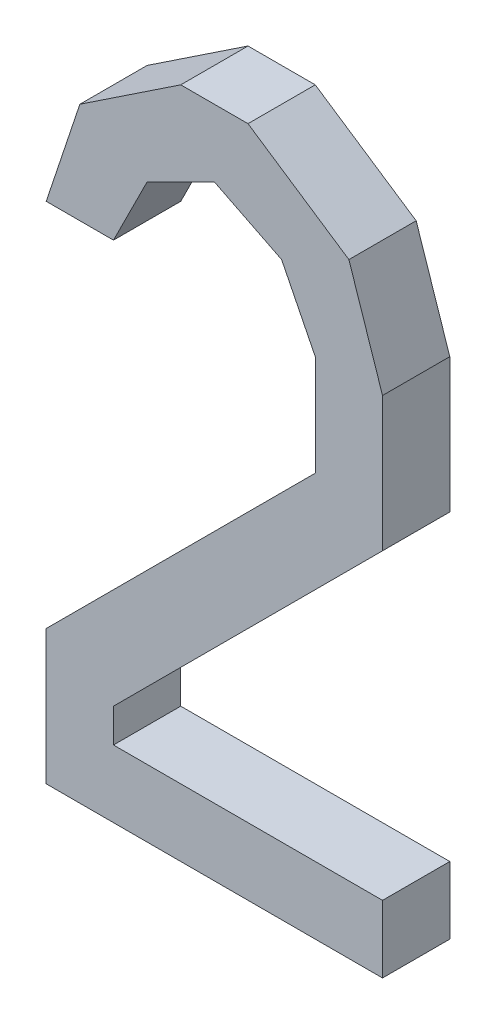
ISO-10303-21;
HEADER;
FILE_DESCRIPTION(('STEP AP214'),'2;1');
FILE_NAME('part.step','',(''),(''),'','','');
FILE_SCHEMA(('AUTOMOTIVE_DESIGN { 1 0 10303 214 1 1 1 1 }'));
ENDSEC;
DATA;
#1=APPLICATION_CONTEXT('core data for automotive mechanical design processes');
#2=APPLICATION_PROTOCOL_DEFINITION('international standard','automotive_design',2000,#1);
#3=PRODUCT_CONTEXT('',#1,'mechanical');
#4=PRODUCT('Part','Part','',(#3));
#5=PRODUCT_RELATED_PRODUCT_CATEGORY('part','',(#4));
#6=PRODUCT_DEFINITION_FORMATION('','',#4);
#7=PRODUCT_DEFINITION_CONTEXT('part definition',#1,'design');
#8=PRODUCT_DEFINITION('design','',#6,#7);
#9=PRODUCT_DEFINITION_SHAPE('','',#8);
#10=(LENGTH_UNIT() NAMED_UNIT(*) SI_UNIT(.MILLI.,.METRE.));
#11=(NAMED_UNIT(*) PLANE_ANGLE_UNIT() SI_UNIT($,.RADIAN.));
#12=(NAMED_UNIT(*) SI_UNIT($,.STERADIAN.) SOLID_ANGLE_UNIT());
#13=UNCERTAINTY_MEASURE_WITH_UNIT(LENGTH_MEASURE(1.E-05),#10,'distance_accuracy_value','');
#14=(GEOMETRIC_REPRESENTATION_CONTEXT(3) GLOBAL_UNCERTAINTY_ASSIGNED_CONTEXT((#13)) GLOBAL_UNIT_ASSIGNED_CONTEXT((#10,
#11,#12)) REPRESENTATION_CONTEXT('',''));
#15=CARTESIAN_POINT('',(0.,0.,0.));
#16=DIRECTION('',(0.,0.,1.));
#17=DIRECTION('',(1.,0.,0.));
#18=AXIS2_PLACEMENT_3D('',#15,#16,#17);
#19=CARTESIAN_POINT('',(-0.06349999999999,-0.127,0.0254));
#20=DIRECTION('',(0.,0.,1.));
#21=DIRECTION('',(1.,0.,0.));
#22=AXIS2_PLACEMENT_3D('',#19,#20,#21);
#23=PLANE('',#22);
#24=DIRECTION('',(-0.707106781186048,-0.707106781187048,0.));
#25=VECTOR('',#24,1.);
#26=CARTESIAN_POINT('',(-0.06349999999999,-0.0762,0.0254));
#27=LINE('',#26,#25);
#28=CARTESIAN_POINT('',(-0.06349999999999,-0.0762,0.0254));
#29=VERTEX_POINT('',#28);
#30=CARTESIAN_POINT('',(0.0380999999999858,0.0254000000000342,0.0254));
#31=VERTEX_POINT('',#30);
#32=EDGE_CURVE('E227',#29,#31,#27,.F.);
#33=ORIENTED_EDGE('',*,*,#32,.F.);
#34=DIRECTION('',(0.,1.,0.));
#35=VECTOR('',#34,1.);
#36=CARTESIAN_POINT('',(-0.06349999999999,-0.127,0.0254));
#37=LINE('',#36,#35);
#38=CARTESIAN_POINT('',(-0.06349999999999,-0.127,0.0254));
#39=VERTEX_POINT('',#38);
#40=EDGE_CURVE('E160',#39,#29,#37,.T.);
#41=ORIENTED_EDGE('',*,*,#40,.F.);
#42=DIRECTION('',(1.,0.,0.));
#43=VECTOR('',#42,1.);
#44=CARTESIAN_POINT('',(0.0635,-0.127,0.0254));
#45=LINE('',#44,#43);
#46=CARTESIAN_POINT('',(0.0635,-0.127,0.0254));
#47=VERTEX_POINT('',#46);
#48=EDGE_CURVE('E20',#47,#39,#45,.F.);
#49=ORIENTED_EDGE('',*,*,#48,.F.);
#50=DIRECTION('',(0.,1.,0.));
#51=VECTOR('',#50,1.);
#52=CARTESIAN_POINT('',(0.0635,-0.1016,0.0254));
#53=LINE('',#52,#51);
#54=CARTESIAN_POINT('',(0.0635,-0.1016,0.0254));
#55=VERTEX_POINT('',#54);
#56=EDGE_CURVE('E149',#55,#47,#53,.F.);
#57=ORIENTED_EDGE('',*,*,#56,.F.);
#58=DIRECTION('',(1.,0.,0.));
#59=VECTOR('',#58,1.);
#60=CARTESIAN_POINT('',(-0.0381,-0.1016,0.0254));
#61=LINE('',#60,#59);
#62=CARTESIAN_POINT('',(-0.0381,-0.1016,0.0254));
#63=VERTEX_POINT('',#62);
#64=EDGE_CURVE('E144',#63,#55,#61,.T.);
#65=ORIENTED_EDGE('',*,*,#64,.F.);
#66=DIRECTION('',(0.,1.,0.));
#67=VECTOR('',#66,1.);
#68=CARTESIAN_POINT('',(-0.0381,-0.0889,0.0254));
#69=LINE('',#68,#67);
#70=CARTESIAN_POINT('',(-0.038100000000018,-0.088899999999982,0.0254));
#71=VERTEX_POINT('',#70);
#72=EDGE_CURVE('E171',#71,#63,#69,.F.);
#73=ORIENTED_EDGE('',*,*,#72,.F.);
#74=DIRECTION('',(0.707106781187048,0.707106781186048,0.));
#75=VECTOR('',#74,1.);
#76=CARTESIAN_POINT('',(0.0635,0.0127,0.0254));
#77=LINE('',#76,#75);
#78=CARTESIAN_POINT('',(0.0635,0.0127,0.0254));
#79=VERTEX_POINT('',#78);
#80=EDGE_CURVE('E175',#79,#71,#77,.F.);
#81=ORIENTED_EDGE('',*,*,#80,.F.);
#82=DIRECTION('',(0.,1.,0.));
#83=VECTOR('',#82,1.);
#84=CARTESIAN_POINT('',(0.0635,0.0635,0.0254));
#85=LINE('',#84,#83);
#86=CARTESIAN_POINT('',(0.0635000000000023,0.0635000000000005,0.0254));
#87=VERTEX_POINT('',#86);
#88=EDGE_CURVE('E179',#87,#79,#85,.F.);
#89=ORIENTED_EDGE('',*,*,#88,.F.);
#90=DIRECTION('',(-0.316227766016838,0.948683298050514,0.));
#91=VECTOR('',#90,1.);
#92=CARTESIAN_POINT('',(0.05080000000001,0.1016,0.0254));
#93=LINE('',#92,#91);
#94=CARTESIAN_POINT('',(0.0508000000000118,0.101600000000003,0.0254));
#95=VERTEX_POINT('',#94);
#96=EDGE_CURVE('E183',#95,#87,#93,.F.);
#97=ORIENTED_EDGE('',*,*,#96,.F.);
#98=DIRECTION('',(-0.832050294337997,0.554700196224998,0.));
#99=VECTOR('',#98,1.);
#100=CARTESIAN_POINT('',(0.01270000000001,0.127,0.0254));
#101=LINE('',#100,#99);
#102=CARTESIAN_POINT('',(0.01270000000001,0.127,0.0254));
#103=VERTEX_POINT('',#102);
#104=EDGE_CURVE('E187',#103,#95,#101,.F.);
#105=ORIENTED_EDGE('',*,*,#104,.F.);
#106=DIRECTION('',(1.,0.,0.));
#107=VECTOR('',#106,1.);
#108=CARTESIAN_POINT('',(-0.0127,0.127,0.0254));
#109=LINE('',#108,#107);
#110=CARTESIAN_POINT('',(-0.0126999999999983,0.126999999999997,0.0254));
#111=VERTEX_POINT('',#110);
#112=EDGE_CURVE('E191',#111,#103,#109,.T.);
#113=ORIENTED_EDGE('',*,*,#112,.F.);
#114=DIRECTION('',(-0.832050294337997,-0.554700196224998,0.));
#115=VECTOR('',#114,1.);
#116=CARTESIAN_POINT('',(-0.0508,0.1016,0.0254));
#117=LINE('',#116,#115);
#118=CARTESIAN_POINT('',(-0.0507999999999977,0.101599999999999,0.0254));
#119=VERTEX_POINT('',#118);
#120=EDGE_CURVE('E195',#119,#111,#117,.F.);
#121=ORIENTED_EDGE('',*,*,#120,.F.);
#122=DIRECTION('',(-0.316227766016838,-0.948683298050514,0.));
#123=VECTOR('',#122,1.);
#124=CARTESIAN_POINT('',(-0.06349999999999,0.0635,0.0254));
#125=LINE('',#124,#123);
#126=CARTESIAN_POINT('',(-0.06349999999999,0.0635,0.0254));
#127=VERTEX_POINT('',#126);
#128=EDGE_CURVE('E199',#127,#119,#125,.F.);
#129=ORIENTED_EDGE('',*,*,#128,.F.);
#130=DIRECTION('',(1.,0.,0.));
#131=VECTOR('',#130,1.);
#132=CARTESIAN_POINT('',(-0.0381,0.0635,0.0254));
#133=LINE('',#132,#131);
#134=CARTESIAN_POINT('',(-0.038099999999998,0.063499999999999,0.0254));
#135=VERTEX_POINT('',#134);
#136=EDGE_CURVE('E203',#135,#127,#133,.F.);
#137=ORIENTED_EDGE('',*,*,#136,.F.);
#138=DIRECTION('',(0.447213595499958,0.894427190999916,0.));
#139=VECTOR('',#138,1.);
#140=CARTESIAN_POINT('',(-0.02539999999999,0.0889,0.0254));
#141=LINE('',#140,#139);
#142=CARTESIAN_POINT('',(-0.0253999999999877,0.0888999999999953,0.0254));
#143=VERTEX_POINT('',#142);
#144=EDGE_CURVE('E207',#143,#135,#141,.F.);
#145=ORIENTED_EDGE('',*,*,#144,.F.);
#146=DIRECTION('',(0.894427190999516,0.447213595500758,0.));
#147=VECTOR('',#146,1.);
#148=CARTESIAN_POINT('',(0.,0.1016,0.0254));
#149=LINE('',#148,#147);
#150=CARTESIAN_POINT('',(0.,0.101600000000006,0.0254));
#151=VERTEX_POINT('',#150);
#152=EDGE_CURVE('E211',#151,#143,#149,.F.);
#153=ORIENTED_EDGE('',*,*,#152,.F.);
#154=DIRECTION('',(0.894427190999516,-0.447213595500758,0.));
#155=VECTOR('',#154,1.);
#156=CARTESIAN_POINT('',(0.0254,0.0889,0.0254));
#157=LINE('',#156,#155);
#158=CARTESIAN_POINT('',(0.0254,0.0889,0.0254));
#159=VERTEX_POINT('',#158);
#160=EDGE_CURVE('E215',#159,#151,#157,.F.);
#161=ORIENTED_EDGE('',*,*,#160,.F.);
#162=DIRECTION('',(0.447213595499958,-0.894427190999916,0.));
#163=VECTOR('',#162,1.);
#164=CARTESIAN_POINT('',(0.0381,0.0635,0.0254));
#165=LINE('',#164,#163);
#166=CARTESIAN_POINT('',(0.0381,0.0635,0.0254));
#167=VERTEX_POINT('',#166);
#168=EDGE_CURVE('E219',#167,#159,#165,.F.);
#169=ORIENTED_EDGE('',*,*,#168,.F.);
#170=DIRECTION('',(0.,1.,0.));
#171=VECTOR('',#170,1.);
#172=CARTESIAN_POINT('',(0.0381,0.02540000000002,0.0254));
#173=LINE('',#172,#171);
#174=EDGE_CURVE('E223',#31,#167,#173,.T.);
#175=ORIENTED_EDGE('',*,*,#174,.F.);
#176=EDGE_LOOP('',(#33,#41,#49,#57,#65,#73,#81,#89,#97,#105,#113,#121,#129,#137,#145,#153,#161,
#169,#175));
#177=FACE_BOUND('',#176,.T.);
#178=ADVANCED_FACE('F17',(#177),#23,.T.);
#179=CARTESIAN_POINT('',(0.0635,-0.127,0.));
#180=DIRECTION('',(0.,-1.,0.));
#181=DIRECTION('',(0.,0.,-1.));
#182=AXIS2_PLACEMENT_3D('',#179,#180,#181);
#183=PLANE('',#182);
#184=DIRECTION('',(0.,0.,1.));
#185=VECTOR('',#184,1.);
#186=CARTESIAN_POINT('',(-0.06349999999999,-0.127,0.));
#187=LINE('',#186,#185);
#188=CARTESIAN_POINT('',(-0.06349999999999,-0.127,0.));
#189=VERTEX_POINT('',#188);
#190=EDGE_CURVE('E231',#189,#39,#187,.T.);
#191=ORIENTED_EDGE('',*,*,#190,.F.);
#192=DIRECTION('',(1.,0.,0.));
#193=VECTOR('',#192,1.);
#194=CARTESIAN_POINT('',(-0.06349999999999,-0.127,0.));
#195=LINE('',#194,#193);
#196=CARTESIAN_POINT('',(0.0635,-0.127,0.));
#197=VERTEX_POINT('',#196);
#198=EDGE_CURVE('E166',#189,#197,#195,.T.);
#199=ORIENTED_EDGE('',*,*,#198,.T.);
#200=DIRECTION('',(0.,0.,-1.));
#201=VECTOR('',#200,1.);
#202=CARTESIAN_POINT('',(0.0635,-0.127,0.));
#203=LINE('',#202,#201);
#204=EDGE_CURVE('E154',#47,#197,#203,.T.);
#205=ORIENTED_EDGE('',*,*,#204,.F.);
#206=ORIENTED_EDGE('',*,*,#48,.T.);
#207=EDGE_LOOP('',(#191,#199,#205,#206));
#208=FACE_BOUND('',#207,.T.);
#209=ADVANCED_FACE('F165',(#208),#183,.T.);
#210=CARTESIAN_POINT('',(0.0635,-0.1016,0.));
#211=DIRECTION('',(1.,0.,0.));
#212=DIRECTION('',(0.,0.,-1.));
#213=AXIS2_PLACEMENT_3D('',#210,#211,#212);
#214=PLANE('',#213);
#215=ORIENTED_EDGE('',*,*,#204,.T.);
#216=DIRECTION('',(0.,1.,0.));
#217=VECTOR('',#216,1.);
#218=CARTESIAN_POINT('',(0.0635,-0.127,0.));
#219=LINE('',#218,#217);
#220=CARTESIAN_POINT('',(0.0635,-0.1016,0.));
#221=VERTEX_POINT('',#220);
#222=EDGE_CURVE('E236',#197,#221,#219,.T.);
#223=ORIENTED_EDGE('',*,*,#222,.T.);
#224=DIRECTION('',(0.,0.,1.));
#225=VECTOR('',#224,1.);
#226=CARTESIAN_POINT('',(0.0635,-0.1016,0.));
#227=LINE('',#226,#225);
#228=EDGE_CURVE('E156',#55,#221,#227,.F.);
#229=ORIENTED_EDGE('',*,*,#228,.F.);
#230=ORIENTED_EDGE('',*,*,#56,.T.);
#231=EDGE_LOOP('',(#215,#223,#229,#230));
#232=FACE_BOUND('',#231,.T.);
#233=ADVANCED_FACE('F151',(#232),#214,.T.);
#234=CARTESIAN_POINT('',(-0.0381,-0.1016,0.));
#235=DIRECTION('',(0.,1.,0.));
#236=DIRECTION('',(0.,0.,1.));
#237=AXIS2_PLACEMENT_3D('',#234,#235,#236);
#238=PLANE('',#237);
#239=ORIENTED_EDGE('',*,*,#228,.T.);
#240=DIRECTION('',(1.,0.,0.));
#241=VECTOR('',#240,1.);
#242=CARTESIAN_POINT('',(-0.06349999999999,-0.1016,0.));
#243=LINE('',#242,#241);
#244=CARTESIAN_POINT('',(-0.0381,-0.1016,0.));
#245=VERTEX_POINT('',#244);
#246=EDGE_CURVE('E238',#221,#245,#243,.F.);
#247=ORIENTED_EDGE('',*,*,#246,.T.);
#248=DIRECTION('',(0.,0.,-1.));
#249=VECTOR('',#248,1.);
#250=CARTESIAN_POINT('',(-0.0381,-0.1016,0.));
#251=LINE('',#250,#249);
#252=EDGE_CURVE('E173',#63,#245,#251,.T.);
#253=ORIENTED_EDGE('',*,*,#252,.F.);
#254=ORIENTED_EDGE('',*,*,#64,.T.);
#255=EDGE_LOOP('',(#239,#247,#253,#254));
#256=FACE_BOUND('',#255,.T.);
#257=ADVANCED_FACE('F360',(#256),#238,.T.);
#258=CARTESIAN_POINT('',(-0.0381,-0.0889,0.));
#259=DIRECTION('',(1.,0.,0.));
#260=DIRECTION('',(0.,0.,-1.));
#261=AXIS2_PLACEMENT_3D('',#258,#259,#260);
#262=PLANE('',#261);
#263=ORIENTED_EDGE('',*,*,#252,.T.);
#264=DIRECTION('',(0.,1.,0.));
#265=VECTOR('',#264,1.);
#266=CARTESIAN_POINT('',(-0.0381,-0.127,0.));
#267=LINE('',#266,#265);
#268=CARTESIAN_POINT('',(-0.038100000000018,-0.088899999999982,0.));
#269=VERTEX_POINT('',#268);
#270=EDGE_CURVE('E241',#245,#269,#267,.T.);
#271=ORIENTED_EDGE('',*,*,#270,.T.);
#272=DIRECTION('',(0.,0.,1.));
#273=VECTOR('',#272,1.);
#274=CARTESIAN_POINT('',(-0.0381000000000718,-0.0888999999999281,0.));
#275=LINE('',#274,#273);
#276=EDGE_CURVE('E177',#71,#269,#275,.F.);
#277=ORIENTED_EDGE('',*,*,#276,.F.);
#278=ORIENTED_EDGE('',*,*,#72,.T.);
#279=EDGE_LOOP('',(#263,#271,#277,#278));
#280=FACE_BOUND('',#279,.T.);
#281=ADVANCED_FACE('F358',(#280),#262,.T.);
#282=CARTESIAN_POINT('',(0.0635,0.0127,0.));
#283=DIRECTION('',(0.707106781186048,-0.707106781187048,0.));
#284=DIRECTION('',(0.707106781187048,0.707106781186048,0.));
#285=AXIS2_PLACEMENT_3D('',#282,#283,#284);
#286=PLANE('',#285);
#287=ORIENTED_EDGE('',*,*,#276,.T.);
#288=DIRECTION('',(0.707106781186547,0.707106781186548,0.));
#289=VECTOR('',#288,1.);
#290=CARTESIAN_POINT('',(-0.0381,-0.0889,0.));
#291=LINE('',#290,#289);
#292=CARTESIAN_POINT('',(0.0635,0.0127,0.));
#293=VERTEX_POINT('',#292);
#294=EDGE_CURVE('E244',#269,#293,#291,.T.);
#295=ORIENTED_EDGE('',*,*,#294,.T.);
#296=DIRECTION('',(0.,0.,-1.));
#297=VECTOR('',#296,1.);
#298=CARTESIAN_POINT('',(0.0635,0.0127,0.));
#299=LINE('',#298,#297);
#300=EDGE_CURVE('E181',#79,#293,#299,.T.);
#301=ORIENTED_EDGE('',*,*,#300,.F.);
#302=ORIENTED_EDGE('',*,*,#80,.T.);
#303=EDGE_LOOP('',(#287,#295,#301,#302));
#304=FACE_BOUND('',#303,.T.);
#305=ADVANCED_FACE('F354',(#304),#286,.T.);
#306=CARTESIAN_POINT('',(0.0635,0.0635,0.));
#307=DIRECTION('',(1.,0.,0.));
#308=DIRECTION('',(0.,0.,-1.));
#309=AXIS2_PLACEMENT_3D('',#306,#307,#308);
#310=PLANE('',#309);
#311=ORIENTED_EDGE('',*,*,#300,.T.);
#312=DIRECTION('',(0.,1.,0.));
#313=VECTOR('',#312,1.);
#314=CARTESIAN_POINT('',(0.0635,-0.127,0.));
#315=LINE('',#314,#313);
#316=CARTESIAN_POINT('',(0.0635000000000023,0.0635000000000007,0.));
#317=VERTEX_POINT('',#316);
#318=EDGE_CURVE('E247',#293,#317,#315,.T.);
#319=ORIENTED_EDGE('',*,*,#318,.T.);
#320=DIRECTION('',(0.,0.,1.));
#321=VECTOR('',#320,1.);
#322=CARTESIAN_POINT('',(0.063500000000009,0.063500000000003,0.));
#323=LINE('',#322,#321);
#324=EDGE_CURVE('E185',#87,#317,#323,.F.);
#325=ORIENTED_EDGE('',*,*,#324,.F.);
#326=ORIENTED_EDGE('',*,*,#88,.T.);
#327=EDGE_LOOP('',(#311,#319,#325,#326));
#328=FACE_BOUND('',#327,.T.);
#329=ADVANCED_FACE('F348',(#328),#310,.T.);
#330=CARTESIAN_POINT('',(0.05080000000001,0.1016,0.));
#331=DIRECTION('',(0.948683298050514,0.316227766016838,0.));
#332=DIRECTION('',(-0.316227766016838,0.948683298050514,0.));
#333=AXIS2_PLACEMENT_3D('',#330,#331,#332);
#334=PLANE('',#333);
#335=ORIENTED_EDGE('',*,*,#324,.T.);
#336=DIRECTION('',(-0.316227766016614,0.948683298050589,0.));
#337=VECTOR('',#336,1.);
#338=CARTESIAN_POINT('',(0.0635,0.0635,0.));
#339=LINE('',#338,#337);
#340=CARTESIAN_POINT('',(0.0508000000000118,0.101600000000003,0.));
#341=VERTEX_POINT('',#340);
#342=EDGE_CURVE('E250',#317,#341,#339,.T.);
#343=ORIENTED_EDGE('',*,*,#342,.T.);
#344=DIRECTION('',(0.,0.,1.));
#345=VECTOR('',#344,1.);
#346=CARTESIAN_POINT('',(0.050800000000017,0.101600000000011,0.));
#347=LINE('',#346,#345);
#348=EDGE_CURVE('E189',#95,#341,#347,.F.);
#349=ORIENTED_EDGE('',*,*,#348,.F.);
#350=ORIENTED_EDGE('',*,*,#96,.T.);
#351=EDGE_LOOP('',(#335,#343,#349,#350));
#352=FACE_BOUND('',#351,.T.);
#353=ADVANCED_FACE('F344',(#352),#334,.T.);
#354=CARTESIAN_POINT('',(0.01270000000001,0.127,0.));
#355=DIRECTION('',(0.554700196224998,0.832050294337997,0.));
#356=DIRECTION('',(-0.832050294337997,0.554700196224998,0.));
#357=AXIS2_PLACEMENT_3D('',#354,#355,#356);
#358=PLANE('',#357);
#359=ORIENTED_EDGE('',*,*,#348,.T.);
#360=DIRECTION('',(-0.832050294337844,0.554700196225229,0.));
#361=VECTOR('',#360,1.);
#362=CARTESIAN_POINT('',(0.05080000000001,0.1016,0.));
#363=LINE('',#362,#361);
#364=CARTESIAN_POINT('',(0.01270000000001,0.127,0.));
#365=VERTEX_POINT('',#364);
#366=EDGE_CURVE('E253',#341,#365,#363,.T.);
#367=ORIENTED_EDGE('',*,*,#366,.T.);
#368=DIRECTION('',(0.,0.,1.));
#369=VECTOR('',#368,1.);
#370=CARTESIAN_POINT('',(0.01270000000001,0.127,0.));
#371=LINE('',#370,#369);
#372=EDGE_CURVE('E193',#103,#365,#371,.F.);
#373=ORIENTED_EDGE('',*,*,#372,.F.);
#374=ORIENTED_EDGE('',*,*,#104,.T.);
#375=EDGE_LOOP('',(#359,#367,#373,#374));
#376=FACE_BOUND('',#375,.T.);
#377=ADVANCED_FACE('F338',(#376),#358,.T.);
#378=CARTESIAN_POINT('',(-0.0127,0.127,0.));
#379=DIRECTION('',(0.,1.,0.));
#380=DIRECTION('',(0.,0.,1.));
#381=AXIS2_PLACEMENT_3D('',#378,#379,#380);
#382=PLANE('',#381);
#383=ORIENTED_EDGE('',*,*,#372,.T.);
#384=DIRECTION('',(1.,0.,0.));
#385=VECTOR('',#384,1.);
#386=CARTESIAN_POINT('',(-0.06349999999999,0.127,0.));
#387=LINE('',#386,#385);
#388=CARTESIAN_POINT('',(-0.0126999999999982,0.126999999999997,0.));
#389=VERTEX_POINT('',#388);
#390=EDGE_CURVE('E256',#365,#389,#387,.F.);
#391=ORIENTED_EDGE('',*,*,#390,.T.);
#392=DIRECTION('',(0.,0.,1.));
#393=VECTOR('',#392,1.);
#394=CARTESIAN_POINT('',(-0.012699999999993,0.126999999999989,0.));
#395=LINE('',#394,#393);
#396=EDGE_CURVE('E197',#111,#389,#395,.F.);
#397=ORIENTED_EDGE('',*,*,#396,.F.);
#398=ORIENTED_EDGE('',*,*,#112,.T.);
#399=EDGE_LOOP('',(#383,#391,#397,#398));
#400=FACE_BOUND('',#399,.T.);
#401=ADVANCED_FACE('F334',(#400),#382,.T.);
#402=CARTESIAN_POINT('',(-0.0508,0.1016,0.));
#403=DIRECTION('',(-0.554700196224998,0.832050294337997,0.));
#404=DIRECTION('',(-0.832050294337997,-0.554700196224998,0.));
#405=AXIS2_PLACEMENT_3D('',#402,#403,#404);
#406=PLANE('',#405);
#407=ORIENTED_EDGE('',*,*,#396,.T.);
#408=DIRECTION('',(-0.832050294337844,-0.554700196225229,0.));
#409=VECTOR('',#408,1.);
#410=CARTESIAN_POINT('',(-0.0127,0.127,0.));
#411=LINE('',#410,#409);
#412=CARTESIAN_POINT('',(-0.0507999999999977,0.101599999999999,0.));
#413=VERTEX_POINT('',#412);
#414=EDGE_CURVE('E259',#389,#413,#411,.T.);
#415=ORIENTED_EDGE('',*,*,#414,.T.);
#416=DIRECTION('',(0.,0.,1.));
#417=VECTOR('',#416,1.);
#418=CARTESIAN_POINT('',(-0.050799999999991,0.101599999999997,0.));
#419=LINE('',#418,#417);
#420=EDGE_CURVE('E201',#119,#413,#419,.F.);
#421=ORIENTED_EDGE('',*,*,#420,.F.);
#422=ORIENTED_EDGE('',*,*,#120,.T.);
#423=EDGE_LOOP('',(#407,#415,#421,#422));
#424=FACE_BOUND('',#423,.T.);
#425=ADVANCED_FACE('F328',(#424),#406,.T.);
#426=CARTESIAN_POINT('',(-0.06349999999999,0.0635,0.));
#427=DIRECTION('',(-0.948683298050514,0.316227766016838,0.));
#428=DIRECTION('',(-0.316227766016838,-0.948683298050514,0.));
#429=AXIS2_PLACEMENT_3D('',#426,#427,#428);
#430=PLANE('',#429);
#431=ORIENTED_EDGE('',*,*,#420,.T.);
#432=DIRECTION('',(-0.316227766016614,-0.948683298050589,0.));
#433=VECTOR('',#432,1.);
#434=CARTESIAN_POINT('',(-0.0508,0.1016,0.));
#435=LINE('',#434,#433);
#436=CARTESIAN_POINT('',(-0.06349999999999,0.0635,0.));
#437=VERTEX_POINT('',#436);
#438=EDGE_CURVE('E262',#413,#437,#435,.T.);
#439=ORIENTED_EDGE('',*,*,#438,.T.);
#440=DIRECTION('',(0.,0.,-1.));
#441=VECTOR('',#440,1.);
#442=CARTESIAN_POINT('',(-0.06349999999999,0.0635,0.));
#443=LINE('',#442,#441);
#444=EDGE_CURVE('E205',#127,#437,#443,.T.);
#445=ORIENTED_EDGE('',*,*,#444,.F.);
#446=ORIENTED_EDGE('',*,*,#128,.T.);
#447=EDGE_LOOP('',(#431,#439,#445,#446));
#448=FACE_BOUND('',#447,.T.);
#449=ADVANCED_FACE('F324',(#448),#430,.T.);
#450=CARTESIAN_POINT('',(-0.0381,0.0635,0.));
#451=DIRECTION('',(0.,-1.,0.));
#452=DIRECTION('',(0.,0.,-1.));
#453=AXIS2_PLACEMENT_3D('',#450,#451,#452);
#454=PLANE('',#453);
#455=ORIENTED_EDGE('',*,*,#444,.T.);
#456=DIRECTION('',(1.,0.,0.));
#457=VECTOR('',#456,1.);
#458=CARTESIAN_POINT('',(-0.06349999999999,0.0635,0.));
#459=LINE('',#458,#457);
#460=CARTESIAN_POINT('',(-0.038099999999998,0.063499999999999,0.));
#461=VERTEX_POINT('',#460);
#462=EDGE_CURVE('E265',#437,#461,#459,.T.);
#463=ORIENTED_EDGE('',*,*,#462,.T.);
#464=DIRECTION('',(0.,0.,1.));
#465=VECTOR('',#464,1.);
#466=CARTESIAN_POINT('',(-0.038099999999992,0.063499999999996,0.));
#467=LINE('',#466,#465);
#468=EDGE_CURVE('E209',#135,#461,#467,.F.);
#469=ORIENTED_EDGE('',*,*,#468,.F.);
#470=ORIENTED_EDGE('',*,*,#136,.T.);
#471=EDGE_LOOP('',(#455,#463,#469,#470));
#472=FACE_BOUND('',#471,.T.);
#473=ADVANCED_FACE('F318',(#472),#454,.T.);
#474=CARTESIAN_POINT('',(-0.02539999999999,0.0889,0.));
#475=DIRECTION('',(0.894427190999916,-0.447213595499958,0.));
#476=DIRECTION('',(0.447213595499958,0.894427190999916,0.));
#477=AXIS2_PLACEMENT_3D('',#474,#475,#476);
#478=PLANE('',#477);
#479=ORIENTED_EDGE('',*,*,#468,.T.);
#480=DIRECTION('',(0.44721359550024,0.894427190999775,0.));
#481=VECTOR('',#480,1.);
#482=CARTESIAN_POINT('',(-0.0381,0.0635,0.));
#483=LINE('',#482,#481);
#484=CARTESIAN_POINT('',(-0.0253999999999877,0.0888999999999953,0.));
#485=VERTEX_POINT('',#484);
#486=EDGE_CURVE('E268',#461,#485,#483,.T.);
#487=ORIENTED_EDGE('',*,*,#486,.T.);
#488=DIRECTION('',(0.,0.,1.));
#489=VECTOR('',#488,1.);
#490=CARTESIAN_POINT('',(-0.0253999999999806,0.0888999999999813,0.));
#491=LINE('',#490,#489);
#492=EDGE_CURVE('E213',#143,#485,#491,.F.);
#493=ORIENTED_EDGE('',*,*,#492,.F.);
#494=ORIENTED_EDGE('',*,*,#144,.T.);
#495=EDGE_LOOP('',(#479,#487,#493,#494));
#496=FACE_BOUND('',#495,.T.);
#497=ADVANCED_FACE('F314',(#496),#478,.T.);
#498=CARTESIAN_POINT('',(0.,0.1016,0.));
#499=DIRECTION('',(0.447213595500758,-0.894427190999516,0.));
#500=DIRECTION('',(0.894427190999516,0.447213595500758,0.));
#501=AXIS2_PLACEMENT_3D('',#498,#499,#500);
#502=PLANE('',#501);
#503=ORIENTED_EDGE('',*,*,#492,.T.);
#504=DIRECTION('',(0.894427190999845,0.447213595500099,0.));
#505=VECTOR('',#504,1.);
#506=CARTESIAN_POINT('',(-0.02539999999999,0.0889,0.));
#507=LINE('',#506,#505);
#508=CARTESIAN_POINT('',(0.,0.101600000000006,0.));
#509=VERTEX_POINT('',#508);
#510=EDGE_CURVE('E271',#485,#509,#507,.T.);
#511=ORIENTED_EDGE('',*,*,#510,.T.);
#512=DIRECTION('',(0.,0.,1.));
#513=VECTOR('',#512,1.);
#514=CARTESIAN_POINT('',(0.,0.101600000000023,0.));
#515=LINE('',#514,#513);
#516=EDGE_CURVE('E217',#151,#509,#515,.F.);
#517=ORIENTED_EDGE('',*,*,#516,.F.);
#518=ORIENTED_EDGE('',*,*,#152,.T.);
#519=EDGE_LOOP('',(#503,#511,#517,#518));
#520=FACE_BOUND('',#519,.T.);
#521=ADVANCED_FACE('F308',(#520),#502,.T.);
#522=CARTESIAN_POINT('',(0.0254,0.0889,0.));
#523=DIRECTION('',(-0.447213595500758,-0.894427190999516,0.));
#524=DIRECTION('',(0.894427190999516,-0.447213595500758,0.));
#525=AXIS2_PLACEMENT_3D('',#522,#523,#524);
#526=PLANE('',#525);
#527=ORIENTED_EDGE('',*,*,#516,.T.);
#528=DIRECTION('',(0.894427190999916,-0.447213595499958,0.));
#529=VECTOR('',#528,1.);
#530=CARTESIAN_POINT('',(0.,0.1016,0.));
#531=LINE('',#530,#529);
#532=CARTESIAN_POINT('',(0.0254,0.0889,0.));
#533=VERTEX_POINT('',#532);
#534=EDGE_CURVE('E274',#509,#533,#531,.T.);
#535=ORIENTED_EDGE('',*,*,#534,.T.);
#536=DIRECTION('',(0.,0.,1.));
#537=VECTOR('',#536,1.);
#538=CARTESIAN_POINT('',(0.0254,0.0889,0.));
#539=LINE('',#538,#537);
#540=EDGE_CURVE('E221',#159,#533,#539,.F.);
#541=ORIENTED_EDGE('',*,*,#540,.F.);
#542=ORIENTED_EDGE('',*,*,#160,.T.);
#543=EDGE_LOOP('',(#527,#535,#541,#542));
#544=FACE_BOUND('',#543,.T.);
#545=ADVANCED_FACE('F304',(#544),#526,.T.);
#546=CARTESIAN_POINT('',(0.0381,0.0635,0.));
#547=DIRECTION('',(-0.894427190999916,-0.447213595499958,0.));
#548=DIRECTION('',(0.447213595499958,-0.894427190999916,0.));
#549=AXIS2_PLACEMENT_3D('',#546,#547,#548);
#550=PLANE('',#549);
#551=ORIENTED_EDGE('',*,*,#540,.T.);
#552=DIRECTION('',(0.447213595499958,-0.894427190999916,0.));
#553=VECTOR('',#552,1.);
#554=CARTESIAN_POINT('',(0.0254,0.0889,0.));
#555=LINE('',#554,#553);
#556=CARTESIAN_POINT('',(0.0381,0.0635,0.));
#557=VERTEX_POINT('',#556);
#558=EDGE_CURVE('E277',#533,#557,#555,.T.);
#559=ORIENTED_EDGE('',*,*,#558,.T.);
#560=DIRECTION('',(0.,0.,1.));
#561=VECTOR('',#560,1.);
#562=CARTESIAN_POINT('',(0.0381,0.0635,0.));
#563=LINE('',#562,#561);
#564=EDGE_CURVE('E225',#167,#557,#563,.F.);
#565=ORIENTED_EDGE('',*,*,#564,.F.);
#566=ORIENTED_EDGE('',*,*,#168,.T.);
#567=EDGE_LOOP('',(#551,#559,#565,#566));
#568=FACE_BOUND('',#567,.T.);
#569=ADVANCED_FACE('F298',(#568),#550,.T.);
#570=CARTESIAN_POINT('',(0.0381,0.02540000000002,0.));
#571=DIRECTION('',(-1.,0.,0.));
#572=DIRECTION('',(0.,0.,1.));
#573=AXIS2_PLACEMENT_3D('',#570,#571,#572);
#574=PLANE('',#573);
#575=ORIENTED_EDGE('',*,*,#564,.T.);
#576=DIRECTION('',(0.,1.,0.));
#577=VECTOR('',#576,1.);
#578=CARTESIAN_POINT('',(0.0381,-0.127,0.));
#579=LINE('',#578,#577);
#580=CARTESIAN_POINT('',(0.0380999999999858,0.0254000000000342,0.));
#581=VERTEX_POINT('',#580);
#582=EDGE_CURVE('E280',#557,#581,#579,.F.);
#583=ORIENTED_EDGE('',*,*,#582,.T.);
#584=DIRECTION('',(0.,0.,1.));
#585=VECTOR('',#584,1.);
#586=CARTESIAN_POINT('',(0.0380999999999432,0.0254000000000768,0.));
#587=LINE('',#586,#585);
#588=EDGE_CURVE('E229',#31,#581,#587,.F.);
#589=ORIENTED_EDGE('',*,*,#588,.F.);
#590=ORIENTED_EDGE('',*,*,#174,.T.);
#591=EDGE_LOOP('',(#575,#583,#589,#590));
#592=FACE_BOUND('',#591,.T.);
#593=ADVANCED_FACE('F293',(#592),#574,.T.);
#594=CARTESIAN_POINT('',(-0.06349999999999,-0.0762,0.));
#595=DIRECTION('',(-0.707106781187048,0.707106781186048,0.));
#596=DIRECTION('',(-0.707106781186048,-0.707106781187048,0.));
#597=AXIS2_PLACEMENT_3D('',#594,#595,#596);
#598=PLANE('',#597);
#599=ORIENTED_EDGE('',*,*,#588,.T.);
#600=DIRECTION('',(-0.707106781186443,-0.707106781186652,0.));
#601=VECTOR('',#600,1.);
#602=CARTESIAN_POINT('',(0.0381,0.02540000000002,0.));
#603=LINE('',#602,#601);
#604=CARTESIAN_POINT('',(-0.06349999999999,-0.0762,0.));
#605=VERTEX_POINT('',#604);
#606=EDGE_CURVE('E26',#581,#605,#603,.T.);
#607=ORIENTED_EDGE('',*,*,#606,.T.);
#608=DIRECTION('',(0.,0.,1.));
#609=VECTOR('',#608,1.);
#610=CARTESIAN_POINT('',(-0.06349999999999,-0.0762,0.));
#611=LINE('',#610,#609);
#612=EDGE_CURVE('E34',#29,#605,#611,.F.);
#613=ORIENTED_EDGE('',*,*,#612,.F.);
#614=ORIENTED_EDGE('',*,*,#32,.T.);
#615=EDGE_LOOP('',(#599,#607,#613,#614));
#616=FACE_BOUND('',#615,.T.);
#617=ADVANCED_FACE('F286',(#616),#598,.T.);
#618=CARTESIAN_POINT('',(-0.06349999999999,-0.127,0.));
#619=DIRECTION('',(-1.,0.,0.));
#620=DIRECTION('',(0.,0.,1.));
#621=AXIS2_PLACEMENT_3D('',#618,#619,#620);
#622=PLANE('',#621);
#623=ORIENTED_EDGE('',*,*,#612,.T.);
#624=DIRECTION('',(0.,1.,0.));
#625=VECTOR('',#624,1.);
#626=CARTESIAN_POINT('',(-0.06349999999999,-0.127,0.));
#627=LINE('',#626,#625);
#628=EDGE_CURVE('E11',#605,#189,#627,.F.);
#629=ORIENTED_EDGE('',*,*,#628,.T.);
#630=ORIENTED_EDGE('',*,*,#190,.T.);
#631=ORIENTED_EDGE('',*,*,#40,.T.);
#632=EDGE_LOOP('',(#623,#629,#630,#631));
#633=FACE_BOUND('',#632,.T.);
#634=ADVANCED_FACE('F371',(#633),#622,.T.);
#635=CARTESIAN_POINT('',(-0.06349999999999,-0.127,0.));
#636=DIRECTION('',(0.,0.,1.));
#637=DIRECTION('',(1.,0.,0.));
#638=AXIS2_PLACEMENT_3D('',#635,#636,#637);
#639=PLANE('',#638);
#640=ORIENTED_EDGE('',*,*,#606,.F.);
#641=ORIENTED_EDGE('',*,*,#582,.F.);
#642=ORIENTED_EDGE('',*,*,#558,.F.);
#643=ORIENTED_EDGE('',*,*,#534,.F.);
#644=ORIENTED_EDGE('',*,*,#510,.F.);
#645=ORIENTED_EDGE('',*,*,#486,.F.);
#646=ORIENTED_EDGE('',*,*,#462,.F.);
#647=ORIENTED_EDGE('',*,*,#438,.F.);
#648=ORIENTED_EDGE('',*,*,#414,.F.);
#649=ORIENTED_EDGE('',*,*,#390,.F.);
#650=ORIENTED_EDGE('',*,*,#366,.F.);
#651=ORIENTED_EDGE('',*,*,#342,.F.);
#652=ORIENTED_EDGE('',*,*,#318,.F.);
#653=ORIENTED_EDGE('',*,*,#294,.F.);
#654=ORIENTED_EDGE('',*,*,#270,.F.);
#655=ORIENTED_EDGE('',*,*,#246,.F.);
#656=ORIENTED_EDGE('',*,*,#222,.F.);
#657=ORIENTED_EDGE('',*,*,#198,.F.);
#658=ORIENTED_EDGE('',*,*,#628,.F.);
#659=EDGE_LOOP('',(#640,#641,#642,#643,#644,#645,#646,#647,#648,#649,#650,#651,#652,#653,#654,
#655,#656,#657,#658));
#660=FACE_BOUND('',#659,.T.);
#661=ADVANCED_FACE('F290',(#660),#639,.F.);
#662=CLOSED_SHELL('',(#178,#209,#233,#257,#281,#305,#329,#353,#377,#401,#425,#449,#473,#497,
#521,#545,#569,#593,#617,#634,#661));
#663=MANIFOLD_SOLID_BREP('B1',#662);
#664=ADVANCED_BREP_SHAPE_REPRESENTATION('',(#18,#663),#14);
#665=SHAPE_DEFINITION_REPRESENTATION(#9,#664);
ENDSEC;
END-ISO-10303-21;
